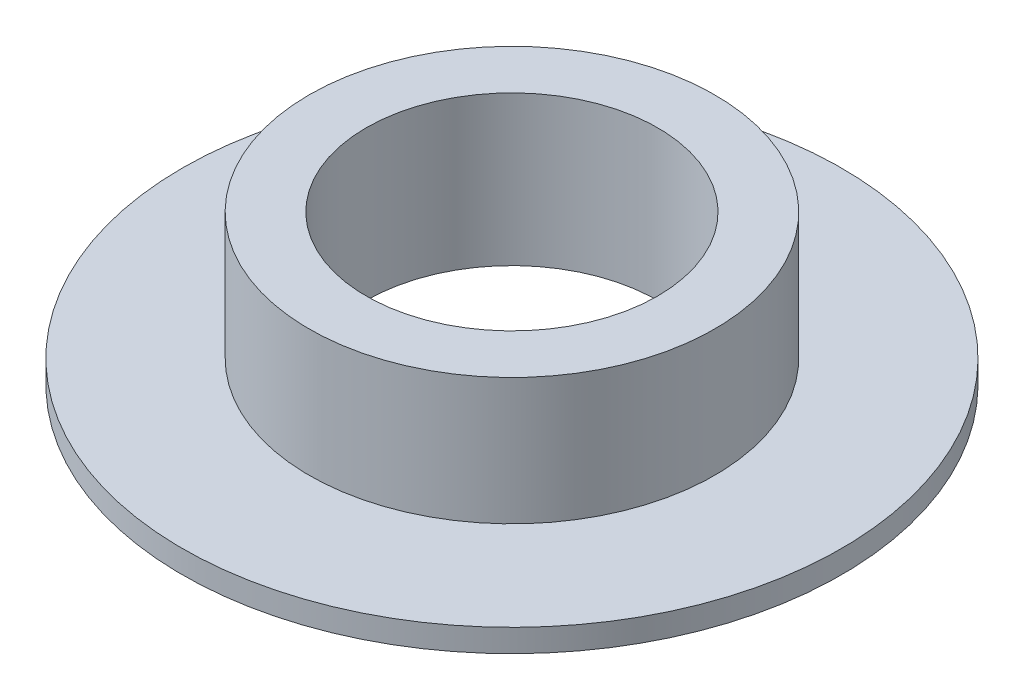
ISO-10303-21;
HEADER;
FILE_DESCRIPTION(('STEP AP214'),'2;1');
FILE_NAME('part.step','',(''),(''),'','','');
FILE_SCHEMA(('AUTOMOTIVE_DESIGN { 1 0 10303 214 1 1 1 1 }'));
ENDSEC;
DATA;
#1=APPLICATION_CONTEXT('core data for automotive mechanical design processes');
#2=APPLICATION_PROTOCOL_DEFINITION('international standard','automotive_design',2000,#1);
#3=PRODUCT_CONTEXT('',#1,'mechanical');
#4=PRODUCT('Part','Part','',(#3));
#5=PRODUCT_RELATED_PRODUCT_CATEGORY('part','',(#4));
#6=PRODUCT_DEFINITION_FORMATION('','',#4);
#7=PRODUCT_DEFINITION_CONTEXT('part definition',#1,'design');
#8=PRODUCT_DEFINITION('design','',#6,#7);
#9=PRODUCT_DEFINITION_SHAPE('','',#8);
#10=(LENGTH_UNIT() NAMED_UNIT(*) SI_UNIT(.MILLI.,.METRE.));
#11=(NAMED_UNIT(*) PLANE_ANGLE_UNIT() SI_UNIT($,.RADIAN.));
#12=(NAMED_UNIT(*) SI_UNIT($,.STERADIAN.) SOLID_ANGLE_UNIT());
#13=UNCERTAINTY_MEASURE_WITH_UNIT(LENGTH_MEASURE(1.E-05),#10,'distance_accuracy_value','');
#14=(GEOMETRIC_REPRESENTATION_CONTEXT(3) GLOBAL_UNCERTAINTY_ASSIGNED_CONTEXT((#13)) GLOBAL_UNIT_ASSIGNED_CONTEXT((#10,
#11,#12)) REPRESENTATION_CONTEXT('',''));
#15=CARTESIAN_POINT('',(0.,0.,0.));
#16=DIRECTION('',(0.,0.,1.));
#17=DIRECTION('',(1.,0.,0.));
#18=AXIS2_PLACEMENT_3D('',#15,#16,#17);
#19=CARTESIAN_POINT('',(-51.5215872800419,8.97288931788123,0.));
#20=DIRECTION('',(0.,1.,0.));
#21=DIRECTION('',(-1.,0.,0.));
#22=AXIS2_PLACEMENT_3D('',#19,#20,#21);
#23=PLANE('',#22);
#24=CARTESIAN_POINT('',(-40.0215872800419,8.97288931788123,0.));
#25=DIRECTION('',(0.,1.,0.));
#26=DIRECTION('',(-1.,0.,0.));
#27=AXIS2_PLACEMENT_3D('',#24,#25,#26);
#28=CIRCLE('',#27,16.);
#29=CARTESIAN_POINT('',(-56.0215872800419,8.97288931788123,0.));
#30=VERTEX_POINT('',#29);
#31=EDGE_CURVE('E10',#30,#30,#28,.T.);
#32=ORIENTED_EDGE('',*,*,#31,.T.);
#33=EDGE_LOOP('',(#32));
#34=FACE_BOUND('',#33,.T.);
#35=CARTESIAN_POINT('',(-40.0215872800419,8.97288931788123,0.));
#36=DIRECTION('',(0.,1.,0.));
#37=DIRECTION('',(-1.,0.,0.));
#38=AXIS2_PLACEMENT_3D('',#35,#36,#37);
#39=CIRCLE('',#38,11.5);
#40=CARTESIAN_POINT('',(-51.5215872800419,8.97288931788123,0.));
#41=VERTEX_POINT('',#40);
#42=EDGE_CURVE('E53',#41,#41,#39,.T.);
#43=ORIENTED_EDGE('',*,*,#42,.F.);
#44=EDGE_LOOP('',(#43));
#45=FACE_BOUND('',#44,.T.);
#46=ADVANCED_FACE('F31',(#34,#45),#23,.T.);
#47=CARTESIAN_POINT('',(-40.0215872800419,13.9728893178812,0.));
#48=DIRECTION('',(0.,1.,0.));
#49=DIRECTION('',(-1.,0.,0.));
#50=AXIS2_PLACEMENT_3D('',#47,#48,#49);
#51=CYLINDRICAL_SURFACE('',#50,16.);
#52=CARTESIAN_POINT('',(-40.0215872800419,-1.02711068211877,0.));
#53=DIRECTION('',(0.,1.,0.));
#54=DIRECTION('',(-1.,0.,0.));
#55=AXIS2_PLACEMENT_3D('',#52,#53,#54);
#56=CIRCLE('',#55,16.);
#57=CARTESIAN_POINT('',(-56.0215872800419,-1.02711068211877,0.));
#58=VERTEX_POINT('',#57);
#59=EDGE_CURVE('E37',#58,#58,#56,.T.);
#60=ORIENTED_EDGE('',*,*,#59,.T.);
#61=EDGE_LOOP('',(#60));
#62=FACE_BOUND('',#61,.T.);
#63=ORIENTED_EDGE('',*,*,#31,.F.);
#64=EDGE_LOOP('',(#63));
#65=FACE_BOUND('',#64,.T.);
#66=ADVANCED_FACE('F61',(#62,#65),#51,.T.);
#67=CARTESIAN_POINT('',(-56.0215872800419,-1.02711068211877,0.));
#68=DIRECTION('',(0.,1.,0.));
#69=DIRECTION('',(-1.,0.,0.));
#70=AXIS2_PLACEMENT_3D('',#67,#68,#69);
#71=PLANE('',#70);
#72=CARTESIAN_POINT('',(-40.0215872800419,-1.02711068211877,0.));
#73=DIRECTION('',(0.,1.,0.));
#74=DIRECTION('',(-1.,0.,0.));
#75=AXIS2_PLACEMENT_3D('',#72,#73,#74);
#76=CIRCLE('',#75,26.);
#77=CARTESIAN_POINT('',(-66.0215872800419,-1.02711068211877,0.));
#78=VERTEX_POINT('',#77);
#79=EDGE_CURVE('E41',#78,#78,#76,.T.);
#80=ORIENTED_EDGE('',*,*,#79,.T.);
#81=EDGE_LOOP('',(#80));
#82=FACE_BOUND('',#81,.T.);
#83=ORIENTED_EDGE('',*,*,#59,.F.);
#84=EDGE_LOOP('',(#83));
#85=FACE_BOUND('',#84,.T.);
#86=ADVANCED_FACE('F65',(#82,#85),#71,.T.);
#87=CARTESIAN_POINT('',(-40.0215872800419,13.9728893178812,0.));
#88=DIRECTION('',(0.,1.,0.));
#89=DIRECTION('',(-1.,0.,0.));
#90=AXIS2_PLACEMENT_3D('',#87,#88,#89);
#91=CYLINDRICAL_SURFACE('',#90,26.);
#92=CARTESIAN_POINT('',(-40.0215872800419,-2.82711068211877,0.));
#93=DIRECTION('',(0.,1.,0.));
#94=DIRECTION('',(-1.,0.,0.));
#95=AXIS2_PLACEMENT_3D('',#92,#93,#94);
#96=CIRCLE('',#95,26.);
#97=CARTESIAN_POINT('',(-66.0215872800419,-2.82711068211877,0.));
#98=VERTEX_POINT('',#97);
#99=EDGE_CURVE('E45',#98,#98,#96,.T.);
#100=ORIENTED_EDGE('',*,*,#99,.T.);
#101=EDGE_LOOP('',(#100));
#102=FACE_BOUND('',#101,.T.);
#103=ORIENTED_EDGE('',*,*,#79,.F.);
#104=EDGE_LOOP('',(#103));
#105=FACE_BOUND('',#104,.T.);
#106=ADVANCED_FACE('F69',(#102,#105),#91,.T.);
#107=CARTESIAN_POINT('',(-66.0215872800419,-2.82711068211877,0.));
#108=DIRECTION('',(0.,-1.,0.));
#109=DIRECTION('',(1.,0.,0.));
#110=AXIS2_PLACEMENT_3D('',#107,#108,#109);
#111=PLANE('',#110);
#112=CARTESIAN_POINT('',(-40.0215872800419,-2.82711068211877,0.));
#113=DIRECTION('',(0.,1.,0.));
#114=DIRECTION('',(-1.,0.,0.));
#115=AXIS2_PLACEMENT_3D('',#112,#113,#114);
#116=CIRCLE('',#115,11.5);
#117=CARTESIAN_POINT('',(-51.5215872800419,-2.82711068211877,0.));
#118=VERTEX_POINT('',#117);
#119=EDGE_CURVE('E50',#118,#118,#116,.T.);
#120=ORIENTED_EDGE('',*,*,#119,.T.);
#121=EDGE_LOOP('',(#120));
#122=FACE_BOUND('',#121,.T.);
#123=ORIENTED_EDGE('',*,*,#99,.F.);
#124=EDGE_LOOP('',(#123));
#125=FACE_BOUND('',#124,.T.);
#126=ADVANCED_FACE('F76',(#122,#125),#111,.T.);
#127=CARTESIAN_POINT('',(-40.0215872800419,13.9728893178812,0.));
#128=DIRECTION('',(0.,1.,0.));
#129=DIRECTION('',(-1.,0.,0.));
#130=AXIS2_PLACEMENT_3D('',#127,#128,#129);
#131=CYLINDRICAL_SURFACE('',#130,11.5);
#132=ORIENTED_EDGE('',*,*,#42,.T.);
#133=EDGE_LOOP('',(#132));
#134=FACE_BOUND('',#133,.T.);
#135=ORIENTED_EDGE('',*,*,#119,.F.);
#136=EDGE_LOOP('',(#135));
#137=FACE_BOUND('',#136,.T.);
#138=ADVANCED_FACE('F57',(#134,#137),#131,.F.);
#139=CLOSED_SHELL('',(#46,#66,#86,#106,#126,#138));
#140=MANIFOLD_SOLID_BREP('B2',#139);
#141=ADVANCED_BREP_SHAPE_REPRESENTATION('',(#18,#140),#14);
#142=SHAPE_DEFINITION_REPRESENTATION(#9,#141);
ENDSEC;
END-ISO-10303-21;
